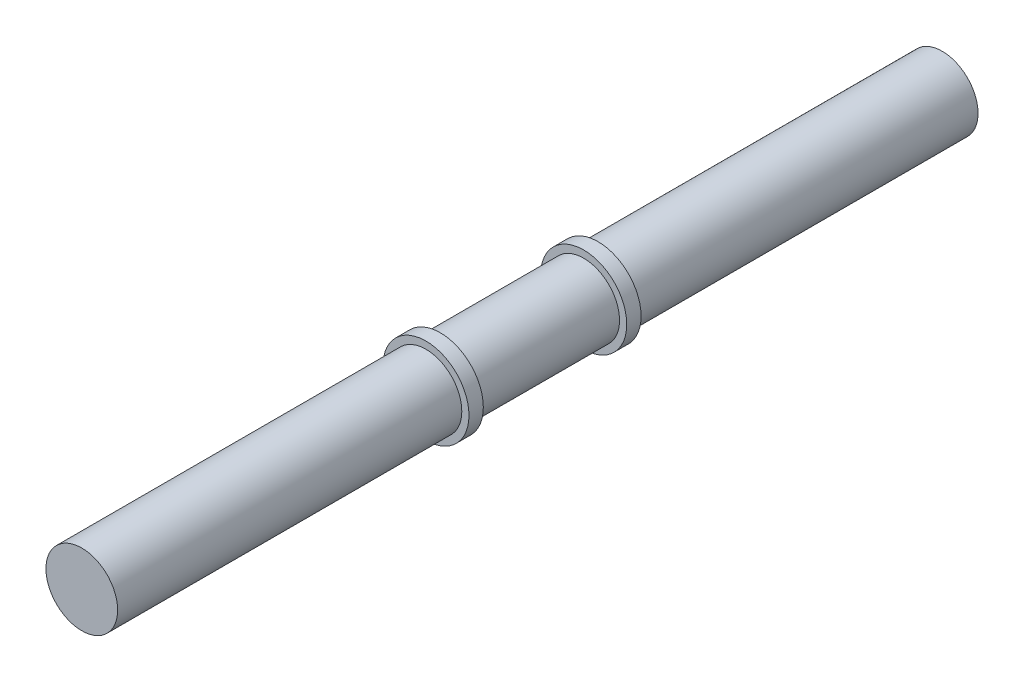
ISO-10303-21;
HEADER;
FILE_DESCRIPTION(('STEP AP214'),'2;1');
FILE_NAME('part.step','',(''),(''),'','','');
FILE_SCHEMA(('AUTOMOTIVE_DESIGN { 1 0 10303 214 1 1 1 1 }'));
ENDSEC;
DATA;
#1=APPLICATION_CONTEXT('core data for automotive mechanical design processes');
#2=APPLICATION_PROTOCOL_DEFINITION('international standard','automotive_design',2000,#1);
#3=PRODUCT_CONTEXT('',#1,'mechanical');
#4=PRODUCT('Part','Part','',(#3));
#5=PRODUCT_RELATED_PRODUCT_CATEGORY('part','',(#4));
#6=PRODUCT_DEFINITION_FORMATION('','',#4);
#7=PRODUCT_DEFINITION_CONTEXT('part definition',#1,'design');
#8=PRODUCT_DEFINITION('design','',#6,#7);
#9=PRODUCT_DEFINITION_SHAPE('','',#8);
#10=(LENGTH_UNIT() NAMED_UNIT(*) SI_UNIT(.MILLI.,.METRE.));
#11=(NAMED_UNIT(*) PLANE_ANGLE_UNIT() SI_UNIT($,.RADIAN.));
#12=(NAMED_UNIT(*) SI_UNIT($,.STERADIAN.) SOLID_ANGLE_UNIT());
#13=UNCERTAINTY_MEASURE_WITH_UNIT(LENGTH_MEASURE(1.E-05),#10,'distance_accuracy_value','');
#14=(GEOMETRIC_REPRESENTATION_CONTEXT(3) GLOBAL_UNCERTAINTY_ASSIGNED_CONTEXT((#13)) GLOBAL_UNIT_ASSIGNED_CONTEXT((#10,
#11,#12)) REPRESENTATION_CONTEXT('',''));
#15=CARTESIAN_POINT('',(0.,0.,0.));
#16=DIRECTION('',(0.,0.,1.));
#17=DIRECTION('',(1.,0.,0.));
#18=AXIS2_PLACEMENT_3D('',#15,#16,#17);
#19=CARTESIAN_POINT('',(0.,0.,191.48));
#20=DIRECTION('',(0.,0.,-1.));
#21=DIRECTION('',(-1.,0.,0.));
#22=AXIS2_PLACEMENT_3D('',#19,#20,#21);
#23=CYLINDRICAL_SURFACE('',#22,5.);
#24=CARTESIAN_POINT('',(0.,0.,83.74));
#25=DIRECTION('',(0.,0.,-1.));
#26=DIRECTION('',(-1.,0.,0.));
#27=AXIS2_PLACEMENT_3D('',#24,#25,#26);
#28=CIRCLE('',#27,5.);
#29=CARTESIAN_POINT('',(-5.,0.,83.74));
#30=VERTEX_POINT('',#29);
#31=EDGE_CURVE('E41',#30,#30,#28,.T.);
#32=ORIENTED_EDGE('',*,*,#31,.T.);
#33=EDGE_LOOP('',(#32));
#34=FACE_BOUND('',#33,.T.);
#35=CARTESIAN_POINT('',(0.,0.,35.74));
#36=DIRECTION('',(0.,0.,-1.));
#37=DIRECTION('',(-1.,0.,0.));
#38=AXIS2_PLACEMENT_3D('',#35,#36,#37);
#39=CIRCLE('',#38,5.);
#40=CARTESIAN_POINT('',(-5.,0.,35.74));
#41=VERTEX_POINT('',#40);
#42=EDGE_CURVE('E77',#41,#41,#39,.T.);
#43=ORIENTED_EDGE('',*,*,#42,.F.);
#44=EDGE_LOOP('',(#43));
#45=FACE_BOUND('',#44,.T.);
#46=ADVANCED_FACE('F37',(#34,#45),#23,.T.);
#47=CARTESIAN_POINT('',(0.,0.,107.74));
#48=DIRECTION('',(0.,0.,1.));
#49=DIRECTION('',(1.,0.,0.));
#50=AXIS2_PLACEMENT_3D('',#47,#48,#49);
#51=CIRCLE('',#50,5.);
#52=CARTESIAN_POINT('',(5.,0.,107.74));
#53=VERTEX_POINT('',#52);
#54=EDGE_CURVE('E51',#53,#53,#51,.T.);
#55=ORIENTED_EDGE('',*,*,#54,.T.);
#56=EDGE_LOOP('',(#55));
#57=FACE_BOUND('',#56,.T.);
#58=CARTESIAN_POINT('',(0.,0.,155.74));
#59=DIRECTION('',(0.,0.,1.));
#60=DIRECTION('',(1.,0.,0.));
#61=AXIS2_PLACEMENT_3D('',#58,#59,#60);
#62=CIRCLE('',#61,5.);
#63=CARTESIAN_POINT('',(5.,0.,155.74));
#64=VERTEX_POINT('',#63);
#65=EDGE_CURVE('E70',#64,#64,#62,.T.);
#66=ORIENTED_EDGE('',*,*,#65,.F.);
#67=EDGE_LOOP('',(#66));
#68=FACE_BOUND('',#67,.T.);
#69=ADVANCED_FACE('F39',(#57,#68),#23,.T.);
#70=CARTESIAN_POINT('',(0.,0.,105.74));
#71=DIRECTION('',(0.,0.,1.));
#72=DIRECTION('',(1.,0.,0.));
#73=AXIS2_PLACEMENT_3D('',#70,#71,#72);
#74=CIRCLE('',#73,5.);
#75=CARTESIAN_POINT('',(5.,0.,105.74));
#76=VERTEX_POINT('',#75);
#77=EDGE_CURVE('E46',#76,#76,#74,.T.);
#78=ORIENTED_EDGE('',*,*,#77,.F.);
#79=EDGE_LOOP('',(#78));
#80=FACE_BOUND('',#79,.T.);
#81=CARTESIAN_POINT('',(0.,0.,85.74));
#82=DIRECTION('',(0.,0.,-1.));
#83=DIRECTION('',(-1.,0.,0.));
#84=AXIS2_PLACEMENT_3D('',#81,#82,#83);
#85=CIRCLE('',#84,5.);
#86=CARTESIAN_POINT('',(-5.,0.,85.74));
#87=VERTEX_POINT('',#86);
#88=EDGE_CURVE('E10',#87,#87,#85,.T.);
#89=ORIENTED_EDGE('',*,*,#88,.F.);
#90=EDGE_LOOP('',(#89));
#91=FACE_BOUND('',#90,.T.);
#92=ADVANCED_FACE('F86',(#80,#91),#23,.T.);
#93=CARTESIAN_POINT('',(0.,0.,107.74));
#94=DIRECTION('',(0.,0.,-1.));
#95=DIRECTION('',(-1.,0.,0.));
#96=AXIS2_PLACEMENT_3D('',#93,#94,#95);
#97=CYLINDRICAL_SURFACE('',#96,6.);
#98=CARTESIAN_POINT('',(0.,0.,107.74));
#99=DIRECTION('',(0.,0.,1.));
#100=DIRECTION('',(1.,0.,0.));
#101=AXIS2_PLACEMENT_3D('',#98,#99,#100);
#102=CIRCLE('',#101,6.);
#103=CARTESIAN_POINT('',(6.,0.,107.74));
#104=VERTEX_POINT('',#103);
#105=EDGE_CURVE('E56',#104,#104,#102,.T.);
#106=ORIENTED_EDGE('',*,*,#105,.F.);
#107=EDGE_LOOP('',(#106));
#108=FACE_BOUND('',#107,.T.);
#109=CARTESIAN_POINT('',(0.,0.,105.74));
#110=DIRECTION('',(0.,0.,1.));
#111=DIRECTION('',(1.,0.,0.));
#112=AXIS2_PLACEMENT_3D('',#109,#110,#111);
#113=CIRCLE('',#112,6.);
#114=CARTESIAN_POINT('',(6.,0.,105.74));
#115=VERTEX_POINT('',#114);
#116=EDGE_CURVE('E58',#115,#115,#113,.T.);
#117=ORIENTED_EDGE('',*,*,#116,.T.);
#118=EDGE_LOOP('',(#117));
#119=FACE_BOUND('',#118,.T.);
#120=ADVANCED_FACE('F95',(#108,#119),#97,.T.);
#121=CARTESIAN_POINT('',(0.,0.,107.74));
#122=DIRECTION('',(0.,0.,1.));
#123=DIRECTION('',(1.,0.,0.));
#124=AXIS2_PLACEMENT_3D('',#121,#122,#123);
#125=PLANE('',#124);
#126=ORIENTED_EDGE('',*,*,#54,.F.);
#127=EDGE_LOOP('',(#126));
#128=FACE_BOUND('',#127,.T.);
#129=ORIENTED_EDGE('',*,*,#105,.T.);
#130=EDGE_LOOP('',(#129));
#131=FACE_BOUND('',#130,.T.);
#132=ADVANCED_FACE('F100',(#128,#131),#125,.T.);
#133=CARTESIAN_POINT('',(0.,0.,105.74));
#134=DIRECTION('',(0.,0.,1.));
#135=DIRECTION('',(1.,0.,0.));
#136=AXIS2_PLACEMENT_3D('',#133,#134,#135);
#137=PLANE('',#136);
#138=ORIENTED_EDGE('',*,*,#77,.T.);
#139=EDGE_LOOP('',(#138));
#140=FACE_BOUND('',#139,.T.);
#141=ORIENTED_EDGE('',*,*,#116,.F.);
#142=EDGE_LOOP('',(#141));
#143=FACE_BOUND('',#142,.T.);
#144=ADVANCED_FACE('F105',(#140,#143),#137,.F.);
#145=CARTESIAN_POINT('',(0.,0.,83.74));
#146=DIRECTION('',(0.,0.,1.));
#147=DIRECTION('',(1.,0.,0.));
#148=AXIS2_PLACEMENT_3D('',#145,#146,#147);
#149=CYLINDRICAL_SURFACE('',#148,6.);
#150=CARTESIAN_POINT('',(0.,0.,83.74));
#151=DIRECTION('',(0.,0.,1.));
#152=DIRECTION('',(1.,0.,0.));
#153=AXIS2_PLACEMENT_3D('',#150,#151,#152);
#154=CIRCLE('',#153,6.);
#155=CARTESIAN_POINT('',(6.,0.,83.74));
#156=VERTEX_POINT('',#155);
#157=EDGE_CURVE('E69',#156,#156,#154,.T.);
#158=ORIENTED_EDGE('',*,*,#157,.T.);
#159=EDGE_LOOP('',(#158));
#160=FACE_BOUND('',#159,.T.);
#161=CARTESIAN_POINT('',(0.,0.,85.74));
#162=DIRECTION('',(0.,0.,1.));
#163=DIRECTION('',(1.,0.,0.));
#164=AXIS2_PLACEMENT_3D('',#161,#162,#163);
#165=CIRCLE('',#164,6.);
#166=CARTESIAN_POINT('',(6.,0.,85.74));
#167=VERTEX_POINT('',#166);
#168=EDGE_CURVE('E65',#167,#167,#165,.T.);
#169=ORIENTED_EDGE('',*,*,#168,.F.);
#170=EDGE_LOOP('',(#169));
#171=FACE_BOUND('',#170,.T.);
#172=ADVANCED_FACE('F108',(#160,#171),#149,.T.);
#173=CARTESIAN_POINT('',(0.,0.,83.74));
#174=DIRECTION('',(0.,0.,-1.));
#175=DIRECTION('',(1.,0.,0.));
#176=AXIS2_PLACEMENT_3D('',#173,#174,#175);
#177=PLANE('',#176);
#178=ORIENTED_EDGE('',*,*,#31,.F.);
#179=EDGE_LOOP('',(#178));
#180=FACE_BOUND('',#179,.T.);
#181=ORIENTED_EDGE('',*,*,#157,.F.);
#182=EDGE_LOOP('',(#181));
#183=FACE_BOUND('',#182,.T.);
#184=ADVANCED_FACE('F116',(#180,#183),#177,.T.);
#185=CARTESIAN_POINT('',(0.,0.,85.74));
#186=DIRECTION('',(0.,0.,-1.));
#187=DIRECTION('',(1.,0.,0.));
#188=AXIS2_PLACEMENT_3D('',#185,#186,#187);
#189=PLANE('',#188);
#190=ORIENTED_EDGE('',*,*,#88,.T.);
#191=EDGE_LOOP('',(#190));
#192=FACE_BOUND('',#191,.T.);
#193=ORIENTED_EDGE('',*,*,#168,.T.);
#194=EDGE_LOOP('',(#193));
#195=FACE_BOUND('',#194,.T.);
#196=ADVANCED_FACE('F122',(#192,#195),#189,.F.);
#197=CARTESIAN_POINT('',(0.,0.,155.74));
#198=DIRECTION('',(0.,0.,1.));
#199=DIRECTION('',(1.,0.,0.));
#200=AXIS2_PLACEMENT_3D('',#197,#198,#199);
#201=PLANE('',#200);
#202=ORIENTED_EDGE('',*,*,#65,.T.);
#203=EDGE_LOOP('',(#202));
#204=FACE_BOUND('',#203,.T.);
#205=ADVANCED_FACE('F125',(#204),#201,.T.);
#206=CARTESIAN_POINT('',(0.,0.,35.74));
#207=DIRECTION('',(0.,0.,-1.));
#208=DIRECTION('',(-1.,0.,0.));
#209=AXIS2_PLACEMENT_3D('',#206,#207,#208);
#210=PLANE('',#209);
#211=ORIENTED_EDGE('',*,*,#42,.T.);
#212=EDGE_LOOP('',(#211));
#213=FACE_BOUND('',#212,.T.);
#214=ADVANCED_FACE('F82',(#213),#210,.T.);
#215=CLOSED_SHELL('',(#46,#69,#92,#120,#132,#144,#172,#184,#196,#205,#214));
#216=MANIFOLD_SOLID_BREP('B2',#215);
#217=ADVANCED_BREP_SHAPE_REPRESENTATION('',(#18,#216),#14);
#218=SHAPE_DEFINITION_REPRESENTATION(#9,#217);
ENDSEC;
END-ISO-10303-21;
